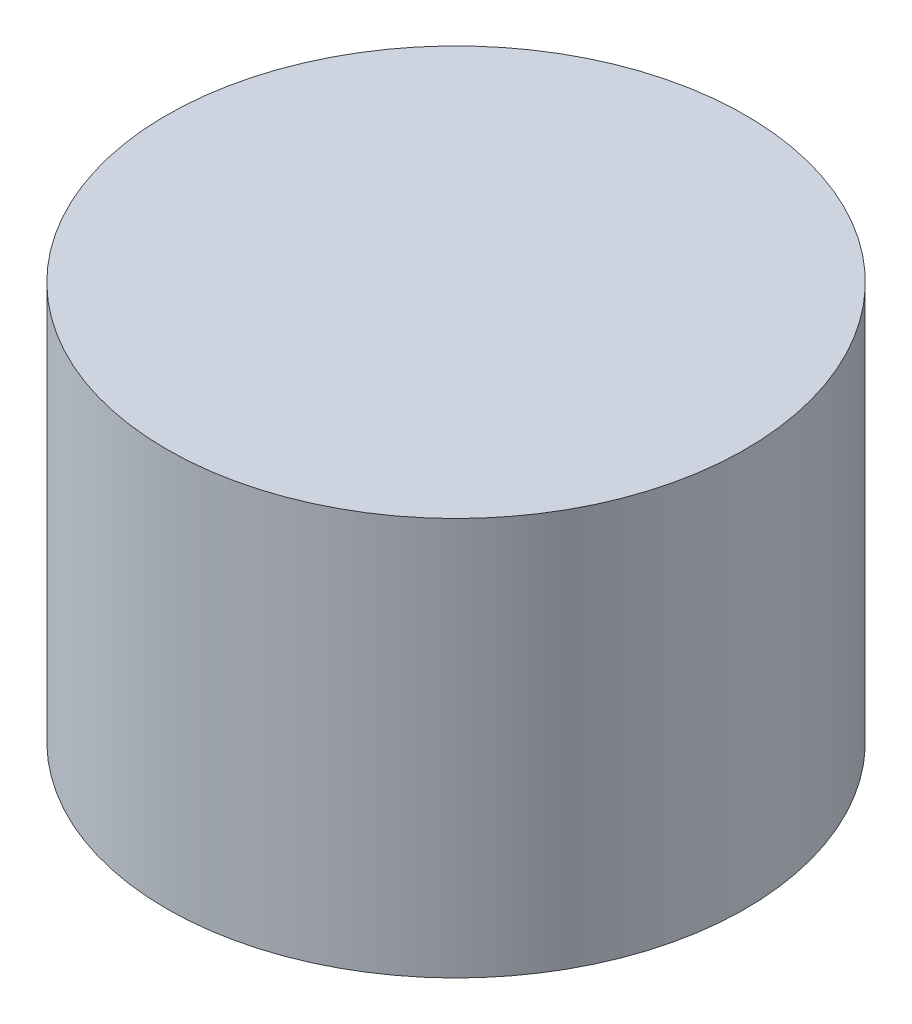
ISO-10303-21;
HEADER;
FILE_DESCRIPTION(('STEP AP214'),'2;1');
FILE_NAME('part.step','',(''),(''),'','','');
FILE_SCHEMA(('AUTOMOTIVE_DESIGN { 1 0 10303 214 1 1 1 1 }'));
ENDSEC;
DATA;
#1=APPLICATION_CONTEXT('core data for automotive mechanical design processes');
#2=APPLICATION_PROTOCOL_DEFINITION('international standard','automotive_design',2000,#1);
#3=PRODUCT_CONTEXT('',#1,'mechanical');
#4=PRODUCT('Part','Part','',(#3));
#5=PRODUCT_RELATED_PRODUCT_CATEGORY('part','',(#4));
#6=PRODUCT_DEFINITION_FORMATION('','',#4);
#7=PRODUCT_DEFINITION_CONTEXT('part definition',#1,'design');
#8=PRODUCT_DEFINITION('design','',#6,#7);
#9=PRODUCT_DEFINITION_SHAPE('','',#8);
#10=(LENGTH_UNIT() NAMED_UNIT(*) SI_UNIT(.MILLI.,.METRE.));
#11=(NAMED_UNIT(*) PLANE_ANGLE_UNIT() SI_UNIT($,.RADIAN.));
#12=(NAMED_UNIT(*) SI_UNIT($,.STERADIAN.) SOLID_ANGLE_UNIT());
#13=UNCERTAINTY_MEASURE_WITH_UNIT(LENGTH_MEASURE(1.E-05),#10,'distance_accuracy_value','');
#14=(GEOMETRIC_REPRESENTATION_CONTEXT(3) GLOBAL_UNCERTAINTY_ASSIGNED_CONTEXT((#13)) GLOBAL_UNIT_ASSIGNED_CONTEXT((#10,
#11,#12)) REPRESENTATION_CONTEXT('',''));
#15=CARTESIAN_POINT('',(0.,0.,0.));
#16=DIRECTION('',(0.,0.,1.));
#17=DIRECTION('',(1.,0.,0.));
#18=AXIS2_PLACEMENT_3D('',#15,#16,#17);
#19=CARTESIAN_POINT('',(0.,-5.5,0.));
#20=DIRECTION('',(0.,1.,0.));
#21=DIRECTION('',(0.,0.,1.));
#22=AXIS2_PLACEMENT_3D('',#19,#20,#21);
#23=CYLINDRICAL_SURFACE('',#22,4.);
#24=CARTESIAN_POINT('',(0.,-5.5,0.));
#25=DIRECTION('',(0.,1.,0.));
#26=DIRECTION('',(0.,0.,1.));
#27=AXIS2_PLACEMENT_3D('',#24,#25,#26);
#28=CIRCLE('',#27,4.);
#29=CARTESIAN_POINT('',(0.,-5.5,4.));
#30=VERTEX_POINT('',#29);
#31=EDGE_CURVE('E10',#30,#30,#28,.T.);
#32=ORIENTED_EDGE('',*,*,#31,.T.);
#33=EDGE_LOOP('',(#32));
#34=FACE_BOUND('',#33,.T.);
#35=CARTESIAN_POINT('',(0.,0.,0.));
#36=DIRECTION('',(0.,1.,0.));
#37=DIRECTION('',(0.,0.,1.));
#38=AXIS2_PLACEMENT_3D('',#35,#36,#37);
#39=CIRCLE('',#38,4.);
#40=CARTESIAN_POINT('',(0.,0.,4.));
#41=VERTEX_POINT('',#40);
#42=EDGE_CURVE('E46',#41,#41,#39,.T.);
#43=ORIENTED_EDGE('',*,*,#42,.F.);
#44=EDGE_LOOP('',(#43));
#45=FACE_BOUND('',#44,.T.);
#46=ADVANCED_FACE('F43',(#34,#45),#23,.T.);
#47=CARTESIAN_POINT('',(0.,-5.5,0.));
#48=DIRECTION('',(0.,1.,0.));
#49=DIRECTION('',(0.,0.,1.));
#50=AXIS2_PLACEMENT_3D('',#47,#48,#49);
#51=PLANE('',#50);
#52=ORIENTED_EDGE('',*,*,#31,.F.);
#53=EDGE_LOOP('',(#52));
#54=FACE_BOUND('',#53,.T.);
#55=ADVANCED_FACE('F60',(#54),#51,.F.);
#56=CARTESIAN_POINT('',(0.,0.,0.));
#57=DIRECTION('',(0.,1.,0.));
#58=DIRECTION('',(0.,0.,1.));
#59=AXIS2_PLACEMENT_3D('',#56,#57,#58);
#60=PLANE('',#59);
#61=ORIENTED_EDGE('',*,*,#42,.T.);
#62=EDGE_LOOP('',(#61));
#63=FACE_BOUND('',#62,.T.);
#64=ADVANCED_FACE('F57',(#63),#60,.T.);
#65=CLOSED_SHELL('',(#46,#55,#64));
#66=MANIFOLD_SOLID_BREP('B2',#65);
#67=ADVANCED_BREP_SHAPE_REPRESENTATION('',(#18,#66),#14);
#68=SHAPE_DEFINITION_REPRESENTATION(#9,#67);
ENDSEC;
END-ISO-10303-21;
